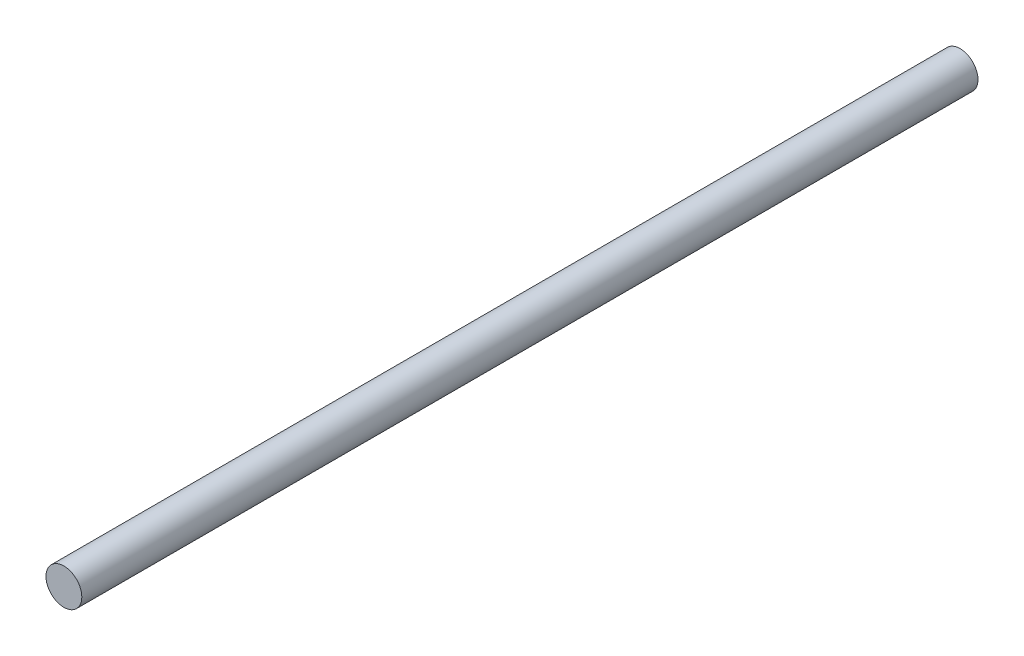
ISO-10303-21;
HEADER;
FILE_DESCRIPTION(('STEP AP214'),'2;1');
FILE_NAME('part.step','',(''),(''),'','','');
FILE_SCHEMA(('AUTOMOTIVE_DESIGN { 1 0 10303 214 1 1 1 1 }'));
ENDSEC;
DATA;
#1=APPLICATION_CONTEXT('core data for automotive mechanical design processes');
#2=APPLICATION_PROTOCOL_DEFINITION('international standard','automotive_design',2000,#1);
#3=PRODUCT_CONTEXT('',#1,'mechanical');
#4=PRODUCT('Part','Part','',(#3));
#5=PRODUCT_RELATED_PRODUCT_CATEGORY('part','',(#4));
#6=PRODUCT_DEFINITION_FORMATION('','',#4);
#7=PRODUCT_DEFINITION_CONTEXT('part definition',#1,'design');
#8=PRODUCT_DEFINITION('design','',#6,#7);
#9=PRODUCT_DEFINITION_SHAPE('','',#8);
#10=(LENGTH_UNIT() NAMED_UNIT(*) SI_UNIT(.MILLI.,.METRE.));
#11=(NAMED_UNIT(*) PLANE_ANGLE_UNIT() SI_UNIT($,.RADIAN.));
#12=(NAMED_UNIT(*) SI_UNIT($,.STERADIAN.) SOLID_ANGLE_UNIT());
#13=UNCERTAINTY_MEASURE_WITH_UNIT(LENGTH_MEASURE(1.E-05),#10,'distance_accuracy_value','');
#14=(GEOMETRIC_REPRESENTATION_CONTEXT(3) GLOBAL_UNCERTAINTY_ASSIGNED_CONTEXT((#13)) GLOBAL_UNIT_ASSIGNED_CONTEXT((#10,
#11,#12)) REPRESENTATION_CONTEXT('',''));
#15=CARTESIAN_POINT('',(0.,0.,0.));
#16=DIRECTION('',(0.,0.,1.));
#17=DIRECTION('',(1.,0.,0.));
#18=AXIS2_PLACEMENT_3D('',#15,#16,#17);
#19=CARTESIAN_POINT('',(0.,7.00000000000402,-16.2));
#20=DIRECTION('',(0.,0.,1.));
#21=DIRECTION('',(1.,0.,0.));
#22=AXIS2_PLACEMENT_3D('',#19,#20,#21);
#23=PLANE('',#22);
#24=CARTESIAN_POINT('',(0.,7.00000000000402,-16.2));
#25=DIRECTION('',(0.,0.,1.));
#26=DIRECTION('',(-1.,0.,0.));
#27=AXIS2_PLACEMENT_3D('',#24,#25,#26);
#28=CIRCLE('',#27,0.6);
#29=CARTESIAN_POINT('',(0.6,7.00000000000402,-16.2));
#30=VERTEX_POINT('',#29);
#31=EDGE_CURVE('E11',#30,#30,#28,.T.);
#32=ORIENTED_EDGE('',*,*,#31,.F.);
#33=EDGE_LOOP('',(#32));
#34=FACE_BOUND('',#33,.T.);
#35=ADVANCED_FACE('F17',(#34),#23,.F.);
#36=CARTESIAN_POINT('',(0.,7.00000000000402,13.8));
#37=DIRECTION('',(0.,0.,1.));
#38=DIRECTION('',(1.,0.,0.));
#39=AXIS2_PLACEMENT_3D('',#36,#37,#38);
#40=PLANE('',#39);
#41=CARTESIAN_POINT('',(0.,7.00000000000402,13.8));
#42=DIRECTION('',(0.,0.,1.));
#43=DIRECTION('',(-1.,0.,0.));
#44=AXIS2_PLACEMENT_3D('',#41,#42,#43);
#45=CIRCLE('',#44,0.6);
#46=CARTESIAN_POINT('',(0.6,7.00000000000402,13.8));
#47=VERTEX_POINT('',#46);
#48=EDGE_CURVE('E42',#47,#47,#45,.T.);
#49=ORIENTED_EDGE('',*,*,#48,.T.);
#50=EDGE_LOOP('',(#49));
#51=FACE_BOUND('',#50,.T.);
#52=ADVANCED_FACE('F19',(#51),#40,.T.);
#53=CARTESIAN_POINT('',(0.,7.00000000000402,-16.2));
#54=DIRECTION('',(0.,0.,1.));
#55=DIRECTION('',(-1.,0.,0.));
#56=AXIS2_PLACEMENT_3D('',#53,#54,#55);
#57=CYLINDRICAL_SURFACE('',#56,0.6);
#58=ORIENTED_EDGE('',*,*,#48,.F.);
#59=DIRECTION('',(0.,0.,-1.));
#60=VECTOR('',#59,1.);
#61=CARTESIAN_POINT('',(0.6,7.00000000000402,-16.2));
#62=LINE('',#61,#60);
#63=EDGE_CURVE('E26',#47,#30,#62,.T.);
#64=ORIENTED_EDGE('',*,*,#63,.T.);
#65=ORIENTED_EDGE('',*,*,#31,.T.);
#66=ORIENTED_EDGE('',*,*,#63,.F.);
#67=EDGE_LOOP('',(#58,#64,#65,#66));
#68=FACE_BOUND('',#67,.T.);
#69=ADVANCED_FACE('F41',(#68),#57,.T.);
#70=CLOSED_SHELL('',(#35,#52,#69));
#71=MANIFOLD_SOLID_BREP('B1',#70);
#72=ADVANCED_BREP_SHAPE_REPRESENTATION('',(#18,#71),#14);
#73=SHAPE_DEFINITION_REPRESENTATION(#9,#72);
ENDSEC;
END-ISO-10303-21;
